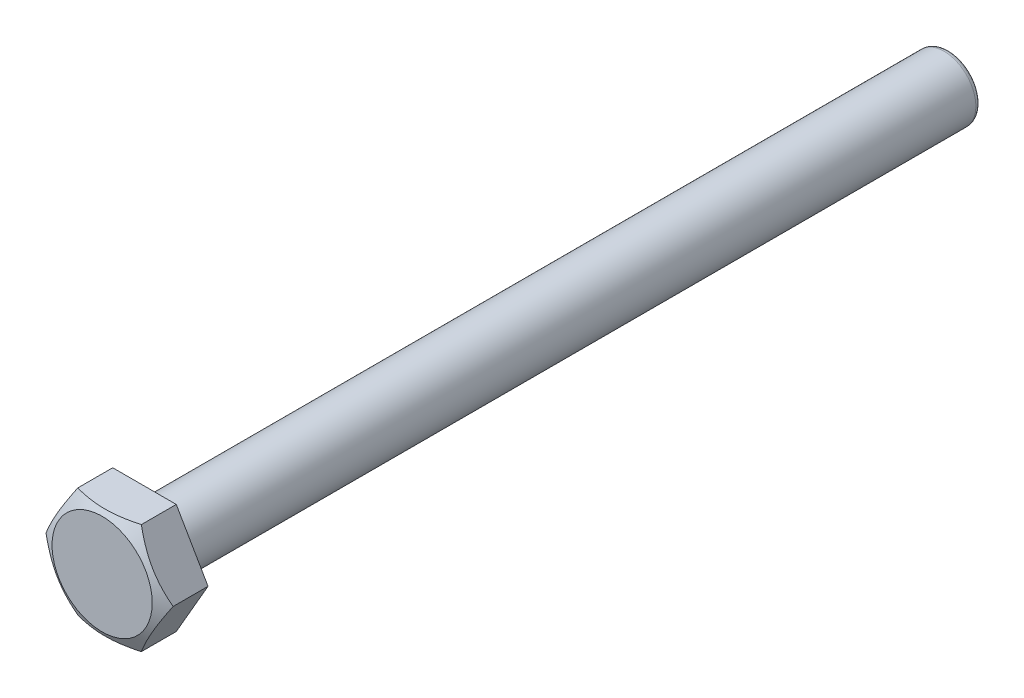
ISO-10303-21;
HEADER;
FILE_DESCRIPTION(('STEP AP214'),'2;1');
FILE_NAME('part.step','',(''),(''),'','','');
FILE_SCHEMA(('AUTOMOTIVE_DESIGN { 1 0 10303 214 1 1 1 1 }'));
ENDSEC;
DATA;
#1=APPLICATION_CONTEXT('core data for automotive mechanical design processes');
#2=APPLICATION_PROTOCOL_DEFINITION('international standard','automotive_design',2000,#1);
#3=PRODUCT_CONTEXT('',#1,'mechanical');
#4=PRODUCT('Part','Part','',(#3));
#5=PRODUCT_RELATED_PRODUCT_CATEGORY('part','',(#4));
#6=PRODUCT_DEFINITION_FORMATION('','',#4);
#7=PRODUCT_DEFINITION_CONTEXT('part definition',#1,'design');
#8=PRODUCT_DEFINITION('design','',#6,#7);
#9=PRODUCT_DEFINITION_SHAPE('','',#8);
#10=(LENGTH_UNIT() NAMED_UNIT(*) SI_UNIT(.MILLI.,.METRE.));
#11=(NAMED_UNIT(*) PLANE_ANGLE_UNIT() SI_UNIT($,.RADIAN.));
#12=(NAMED_UNIT(*) SI_UNIT($,.STERADIAN.) SOLID_ANGLE_UNIT());
#13=UNCERTAINTY_MEASURE_WITH_UNIT(LENGTH_MEASURE(1.E-05),#10,'distance_accuracy_value','');
#14=(GEOMETRIC_REPRESENTATION_CONTEXT(3) GLOBAL_UNCERTAINTY_ASSIGNED_CONTEXT((#13)) GLOBAL_UNIT_ASSIGNED_CONTEXT((#10,
#11,#12)) REPRESENTATION_CONTEXT('',''));
#15=CARTESIAN_POINT('',(0.,0.,0.));
#16=DIRECTION('',(0.,0.,1.));
#17=DIRECTION('',(1.,0.,0.));
#18=AXIS2_PLACEMENT_3D('',#15,#16,#17);
#19=CARTESIAN_POINT('',(3.00000000000005,-5.19615242270659,4.));
#20=DIRECTION('',(-0.866025403784442,0.499999999999995,0.));
#21=DIRECTION('',(-0.499999999999995,-0.866025403784442,0.));
#22=AXIS2_PLACEMENT_3D('',#19,#20,#21);
#23=PLANE('',#22);
#24=CARTESIAN_POINT('',(2.99988452994622,-5.19635242270659,3.29993636752852));
#25=CARTESIAN_POINT('',(3.13120037425521,-4.96890670852461,3.37231821520058));
#26=CARTESIAN_POINT('',(3.26353944494433,-4.73968871426459,3.43812150944553));
#27=CARTESIAN_POINT('',(3.53029736264474,-4.27765044748621,3.55301887201268));
#28=CARTESIAN_POINT('',(3.6647200634845,-4.04482349994109,3.60207677825998));
#29=CARTESIAN_POINT('',(3.93206789695309,-3.58176346908004,3.67871603562647));
#30=CARTESIAN_POINT('',(4.06495857356462,-3.35159006533665,3.70675619592674));
#31=CARTESIAN_POINT('',(4.26473017311514,-3.00557550500584,3.73217837172106));
#32=CARTESIAN_POINT('',(4.33136469480456,-2.89016112790172,3.73788053333798));
#33=CARTESIAN_POINT('',(4.46469401785052,-2.65922796624735,3.74364269272623));
#34=CARTESIAN_POINT('',(4.53138881755607,-2.5437091845567,3.74370284061096));
#35=CARTESIAN_POINT('',(4.71539831783398,-2.224995381,3.7360427664145));
#36=CARTESIAN_POINT('',(4.83266210158002,-2.02188854966408,3.72237485742094));
#37=CARTESIAN_POINT('',(5.06648407118686,-1.61689701837921,3.67845149833568));
#38=CARTESIAN_POINT('',(5.18304158332952,-1.41501348534429,3.64818215602633));
#39=CARTESIAN_POINT('',(5.41730652919732,-1.00925469666888,3.57229441079438));
#40=CARTESIAN_POINT('',(5.53498909636899,-0.805422511162419,3.52637619610927));
#41=CARTESIAN_POINT('',(5.76874191762245,-0.400550748338854,3.42195798803959));
#42=CARTESIAN_POINT('',(5.88481466437232,-0.199506853594004,3.36348048890669));
#43=CARTESIAN_POINT('',(6.00011547005383,0.000199999999999686,3.29993636752853));
#44=B_SPLINE_CURVE_WITH_KNOTS('',3,(#24,#25,#26,#27,#28,#29,#30,#31,#32,#33,#34,#35,#36,#37,#38,
#39,#40,#41,#42,#43),.UNSPECIFIED.,.F.,.F.,(4,2,2,2,2,2,2,2,2,4),(0.,0.817519463468259,
1.63679337331425,2.43761566578922,2.83768454355232,3.23774277694015,3.94183837221327,
4.64652406150167,5.3655497848344,6.08329828274132),.UNSPECIFIED.);
#45=CARTESIAN_POINT('',(3.00000000000006,-5.19615242270659,3.3));
#46=VERTEX_POINT('',#45);
#47=CARTESIAN_POINT('',(5.99999999999999,0.,3.3));
#48=VERTEX_POINT('',#47);
#49=EDGE_CURVE('E87',#46,#48,#44,.T.);
#50=ORIENTED_EDGE('',*,*,#49,.F.);
#51=DIRECTION('',(0.,0.,-1.));
#52=VECTOR('',#51,1.);
#53=CARTESIAN_POINT('',(3.00000000000005,-5.19615242270659,4.));
#54=LINE('',#53,#52);
#55=CARTESIAN_POINT('',(3.00000000000005,-5.19615242270659,0.));
#56=VERTEX_POINT('',#55);
#57=EDGE_CURVE('E58',#46,#56,#54,.T.);
#58=ORIENTED_EDGE('',*,*,#57,.T.);
#59=DIRECTION('',(0.499999999999995,0.866025403784442,0.));
#60=VECTOR('',#59,1.);
#61=CARTESIAN_POINT('',(3.00000000000005,-5.19615242270659,0.));
#62=LINE('',#61,#60);
#63=CARTESIAN_POINT('',(5.99999999999999,0.,0.));
#64=VERTEX_POINT('',#63);
#65=EDGE_CURVE('E94',#56,#64,#62,.T.);
#66=ORIENTED_EDGE('',*,*,#65,.T.);
#67=DIRECTION('',(0.,0.,-1.));
#68=VECTOR('',#67,1.);
#69=CARTESIAN_POINT('',(5.99999999999999,0.,4.));
#70=LINE('',#69,#68);
#71=EDGE_CURVE('E100',#48,#64,#70,.T.);
#72=ORIENTED_EDGE('',*,*,#71,.F.);
#73=EDGE_LOOP('',(#50,#58,#66,#72));
#74=FACE_BOUND('',#73,.T.);
#75=ADVANCED_FACE('F35',(#74),#23,.F.);
#76=CARTESIAN_POINT('',(5.99999999999999,0.,4.));
#77=DIRECTION('',(-0.866025403784438,-0.500000000000001,0.));
#78=DIRECTION('',(0.500000000000001,-0.866025403784438,0.));
#79=AXIS2_PLACEMENT_3D('',#76,#77,#78);
#80=PLANE('',#79);
#81=CARTESIAN_POINT('',(6.00011547005383,-0.000200000000000011,3.29993636752852));
#82=CARTESIAN_POINT('',(5.86879962574484,0.227245714181975,3.37231821520058));
#83=CARTESIAN_POINT('',(5.73646055505571,0.456463708441989,3.43812150944553));
#84=CARTESIAN_POINT('',(5.4697026373553,0.918501975220374,3.55301887201268));
#85=CARTESIAN_POINT('',(5.33527993651553,1.15132892276549,3.60207677825998));
#86=CARTESIAN_POINT('',(5.06793210304695,1.61438895362654,3.67871603562648));
#87=CARTESIAN_POINT('',(4.93504142643541,1.84456235736993,3.70675619592675));
#88=CARTESIAN_POINT('',(4.73526982688489,2.19057691770073,3.73217837172107));
#89=CARTESIAN_POINT('',(4.66863530519547,2.30599129480486,3.73788053333799));
#90=CARTESIAN_POINT('',(4.5353059821495,2.53692445645923,3.74364269272624));
#91=CARTESIAN_POINT('',(4.46861118244395,2.65244323814987,3.74370284061097));
#92=CARTESIAN_POINT('',(4.28460168216604,2.97115704170658,3.73604276641452));
#93=CARTESIAN_POINT('',(4.16733789841999,3.1742638730425,3.72237485742095));
#94=CARTESIAN_POINT('',(3.93351592881314,3.57925540432739,3.67845149833569));
#95=CARTESIAN_POINT('',(3.81695841667048,3.78113893736231,3.64818215602635));
#96=CARTESIAN_POINT('',(3.58269347080267,4.18689772603772,3.57229441079439));
#97=CARTESIAN_POINT('',(3.465010903631,4.39072991154419,3.52637619610928));
#98=CARTESIAN_POINT('',(3.23125808237753,4.79560167436776,3.4219579880396));
#99=CARTESIAN_POINT('',(3.11518533562766,4.99664556911262,3.36348048890669));
#100=CARTESIAN_POINT('',(2.99988452994614,5.19635242270663,3.29993636752853));
#101=B_SPLINE_CURVE_WITH_KNOTS('',3,(#81,#82,#83,#84,#85,#86,#87,#88,#89,#90,#91,#92,#93,#94,
#95,#96,#97,#98,#99,#100),.UNSPECIFIED.,.F.,.F.,(4,2,2,2,2,2,2,2,2,4),(0.,0.817519463468258,
1.63679337331425,2.43761566578922,2.83768454355232,3.23774277694015,3.94183837221328,
4.64652406150171,5.36554978483446,6.0832982827414),.UNSPECIFIED.);
#102=CARTESIAN_POINT('',(2.99999999999998,5.19615242270663,3.3));
#103=VERTEX_POINT('',#102);
#104=EDGE_CURVE('E90',#48,#103,#101,.T.);
#105=ORIENTED_EDGE('',*,*,#104,.F.);
#106=ORIENTED_EDGE('',*,*,#71,.T.);
#107=DIRECTION('',(-0.500000000000001,0.866025403784438,0.));
#108=VECTOR('',#107,1.);
#109=CARTESIAN_POINT('',(5.99999999999999,0.,0.));
#110=LINE('',#109,#108);
#111=CARTESIAN_POINT('',(2.99999999999998,5.19615242270663,0.));
#112=VERTEX_POINT('',#111);
#113=EDGE_CURVE('E209',#64,#112,#110,.T.);
#114=ORIENTED_EDGE('',*,*,#113,.T.);
#115=DIRECTION('',(0.,0.,-1.));
#116=VECTOR('',#115,1.);
#117=CARTESIAN_POINT('',(2.99999999999998,5.19615242270663,4.));
#118=LINE('',#117,#116);
#119=EDGE_CURVE('E102',#103,#112,#118,.T.);
#120=ORIENTED_EDGE('',*,*,#119,.F.);
#121=EDGE_LOOP('',(#105,#106,#114,#120));
#122=FACE_BOUND('',#121,.T.);
#123=ADVANCED_FACE('F98',(#122),#80,.F.);
#124=CARTESIAN_POINT('',(2.99999999999998,5.19615242270663,4.));
#125=DIRECTION('',(0.,-1.,0.));
#126=DIRECTION('',(1.,0.,0.));
#127=AXIS2_PLACEMENT_3D('',#124,#125,#126);
#128=PLANE('',#127);
#129=CARTESIAN_POINT('',(-7.92198431592787,5.19615242270659,1.38559266034994));
#130=CARTESIAN_POINT('',(-7.69326227954885,5.19615242270659,1.49095278034008));
#131=CARTESIAN_POINT('',(-7.46403330139792,5.19615242270659,1.59523252212606));
#132=CARTESIAN_POINT('',(-7.00428906400931,5.19615242270659,1.80101597831413));
#133=CARTESIAN_POINT('',(-6.77377360014843,5.19615242270659,1.90251923501786));
#134=CARTESIAN_POINT('',(-6.31002575217176,5.1961524227066,2.10263157928218));
#135=CARTESIAN_POINT('',(-6.0767854350624,5.1961524227066,2.20122234966374));
#136=CARTESIAN_POINT('',(-5.60851628234075,5.1961524227066,2.39404413592184));
#137=CARTESIAN_POINT('',(-5.37348753503331,5.1961524227066,2.48827536544762));
#138=CARTESIAN_POINT('',(-4.89904131503442,5.1961524227066,2.67209286409355));
#139=CARTESIAN_POINT('',(-4.65960336015394,5.1961524227066,2.7616265569743));
#140=CARTESIAN_POINT('',(-4.17811783883686,5.1961524227066,2.93351382581167));
#141=CARTESIAN_POINT('',(-3.93607001357712,5.1961524227066,3.01586668214091));
#142=CARTESIAN_POINT('',(-3.44949172318917,5.19615242270661,3.17118551715607));
#143=CARTESIAN_POINT('',(-3.2049672843446,5.19615242270661,3.24417018327577));
#144=CARTESIAN_POINT('',(-2.71274475935278,5.19615242270661,3.37838550758616));
#145=CARTESIAN_POINT('',(-2.46504760997054,5.19615242270661,3.43961955361462));
#146=CARTESIAN_POINT('',(-1.96632403136333,5.19615242270661,3.5474117726451));
#147=CARTESIAN_POINT('',(-1.71529638995956,5.19615242270661,3.59396444046187));
#148=CARTESIAN_POINT('',(-1.21052002960329,5.19615242270661,3.66933556405531));
#149=CARTESIAN_POINT('',(-0.956771219161599,5.19615242270661,3.69815342165098));
#150=CARTESIAN_POINT('',(-0.449115035776771,5.19615242270662,3.7356137354557));
#151=CARTESIAN_POINT('',(-0.195215761662992,5.19615242270662,3.74436321942582));
#152=CARTESIAN_POINT('',(0.312390311797005,5.19615242270662,3.7412051851038));
#153=CARTESIAN_POINT('',(0.566097144884676,5.19615242270662,3.72930335153118));
#154=CARTESIAN_POINT('',(1.01176749789605,5.19615242270662,3.69108715053189));
#155=CARTESIAN_POINT('',(1.20409897173807,5.19615242270662,3.66886211887566));
#156=CARTESIAN_POINT('',(1.58729792803549,5.19615242270662,3.61408305260569));
#157=CARTESIAN_POINT('',(1.77816515276921,5.19615242270662,3.58152724054171));
#158=CARTESIAN_POINT('',(2.34892228539402,5.19615242270663,3.47013116561713));
#159=CARTESIAN_POINT('',(2.72616893315937,5.19615242270663,3.37764053263401));
#160=CARTESIAN_POINT('',(3.29043142538852,5.19615242270663,3.21834555065987));
#161=CARTESIAN_POINT('',(3.48030711122072,5.19615242270663,3.16108090431709));
#162=CARTESIAN_POINT('',(3.85830568868335,5.19615242270663,3.04092666432027));
#163=CARTESIAN_POINT('',(4.04642842551327,5.19615242270663,2.97803657899323));
#164=CARTESIAN_POINT('',(4.41994249881478,5.19615242270663,2.84802755076435));
#165=CARTESIAN_POINT('',(4.60534341034003,5.19615242270663,2.78093582891764));
#166=CARTESIAN_POINT('',(4.97466674191132,5.19615242270664,2.64297814233672));
#167=CARTESIAN_POINT('',(5.15858964286321,5.19615242270664,2.57211346761545));
#168=CARTESIAN_POINT('',(5.34189920565052,5.19615242270664,2.49973208755415));
#169=B_SPLINE_CURVE_WITH_KNOTS('',3,(#129,#130,#131,#132,#133,#134,#135,#136,#137,#138,#139,
#140,#141,#142,#143,#144,#145,#146,#147,#148,#149,#150,#151,#152,#153,#154,#155,#156,#157,#158,
#159,#160,#161,#162,#163,#164,#165,#166,#167,#168),.UNSPECIFIED.,.F.,.F.,(4,2,2,2,2,2,2,2,2,2,2,
2,2,2,2,2,2,2,2,4),(0.,0.755476989475552,1.51107777640751,2.27070737140927,3.03029969950886,
3.7971016321675,4.56398032175718,5.32930466697557,6.09440802784875,6.85979794501777,
7.62521367676295,8.38653773982239,9.14765226529749,9.72819096907238,10.308829610956,
11.472503627369,12.0674314382528,12.6624112977505,13.2538710123172,13.8451297831649),.UNSPECIFIED.);
#170=CARTESIAN_POINT('',(-3.00000000000002,5.19615242270661,3.3));
#171=VERTEX_POINT('',#170);
#172=EDGE_CURVE('E103',#103,#171,#169,.F.);
#173=ORIENTED_EDGE('',*,*,#172,.F.);
#174=ORIENTED_EDGE('',*,*,#119,.T.);
#175=DIRECTION('',(-1.,0.,0.));
#176=VECTOR('',#175,1.);
#177=CARTESIAN_POINT('',(2.99999999999998,5.19615242270663,0.));
#178=LINE('',#177,#176);
#179=CARTESIAN_POINT('',(-3.00000000000002,5.19615242270661,0.));
#180=VERTEX_POINT('',#179);
#181=EDGE_CURVE('E210',#112,#180,#178,.T.);
#182=ORIENTED_EDGE('',*,*,#181,.T.);
#183=DIRECTION('',(0.,0.,-1.));
#184=VECTOR('',#183,1.);
#185=CARTESIAN_POINT('',(-3.00000000000002,5.19615242270661,4.));
#186=LINE('',#185,#184);
#187=EDGE_CURVE('E110',#171,#180,#186,.T.);
#188=ORIENTED_EDGE('',*,*,#187,.F.);
#189=EDGE_LOOP('',(#173,#174,#182,#188));
#190=FACE_BOUND('',#189,.T.);
#191=ADVANCED_FACE('F130',(#190),#128,.F.);
#192=CARTESIAN_POINT('',(-3.00000000000002,5.19615242270661,4.));
#193=DIRECTION('',(0.866025403784442,-0.499999999999995,0.));
#194=DIRECTION('',(0.499999999999995,0.866025403784442,0.));
#195=AXIS2_PLACEMENT_3D('',#192,#193,#194);
#196=PLANE('',#195);
#197=CARTESIAN_POINT('',(-2.99988452994618,5.19635242270661,3.29993636752853));
#198=CARTESIAN_POINT('',(-3.13120037425517,4.96890670852463,3.37231821520058));
#199=CARTESIAN_POINT('',(-3.26353944494429,4.73968871426462,3.43812150944553));
#200=CARTESIAN_POINT('',(-3.5302973626447,4.27765044748623,3.55301887201268));
#201=CARTESIAN_POINT('',(-3.66472006348447,4.04482349994112,3.60207677825998));
#202=CARTESIAN_POINT('',(-3.93206789695305,3.58176346908006,3.67871603562648));
#203=CARTESIAN_POINT('',(-4.06495857356459,3.35159006533667,3.70675619592675));
#204=CARTESIAN_POINT('',(-4.26473017311511,3.00557550500586,3.73217837172107));
#205=CARTESIAN_POINT('',(-4.33136469480452,2.89016112790174,3.73788053333799));
#206=CARTESIAN_POINT('',(-4.46469401785049,2.65922796624737,3.74364269272624));
#207=CARTESIAN_POINT('',(-4.53138881755604,2.54370918455672,3.74370284061097));
#208=CARTESIAN_POINT('',(-4.71539831783395,2.22499538100002,3.73604276641452));
#209=CARTESIAN_POINT('',(-4.83266210157999,2.0218885496641,3.72237485742095));
#210=CARTESIAN_POINT('',(-5.06648407118684,1.61689701837921,3.67845149833569));
#211=CARTESIAN_POINT('',(-5.1830415833295,1.41501348534428,3.64818215602635));
#212=CARTESIAN_POINT('',(-5.41730652919731,1.00925469666887,3.57229441079439));
#213=CARTESIAN_POINT('',(-5.53498909636898,0.805422511162398,3.52637619610928));
#214=CARTESIAN_POINT('',(-5.76874191762244,0.400550748338822,3.42195798803959));
#215=CARTESIAN_POINT('',(-5.88481466437231,0.199506853593967,3.36348048890669));
#216=CARTESIAN_POINT('',(-6.00011547005383,-0.000200000000041801,3.29993636752853));
#217=B_SPLINE_CURVE_WITH_KNOTS('',3,(#197,#198,#199,#200,#201,#202,#203,#204,#205,#206,#207,
#208,#209,#210,#211,#212,#213,#214,#215,#216),.UNSPECIFIED.,.F.,.F.,(4,2,2,2,2,2,2,2,2,4),(0.,
0.817519463468259,1.63679337331425,2.43761566578922,2.83768454355232,3.23774277694015,
3.94183837221328,4.64652406150171,5.36554978483446,6.0832982827414),.UNSPECIFIED.);
#218=CARTESIAN_POINT('',(-5.99999999999999,0.,3.3));
#219=VERTEX_POINT('',#218);
#220=EDGE_CURVE('E174',#171,#219,#217,.T.);
#221=ORIENTED_EDGE('',*,*,#220,.F.);
#222=ORIENTED_EDGE('',*,*,#187,.T.);
#223=DIRECTION('',(-0.499999999999995,-0.866025403784442,0.));
#224=VECTOR('',#223,1.);
#225=CARTESIAN_POINT('',(-3.00000000000002,5.19615242270661,0.));
#226=LINE('',#225,#224);
#227=CARTESIAN_POINT('',(-5.99999999999999,0.,0.));
#228=VERTEX_POINT('',#227);
#229=EDGE_CURVE('E212',#180,#228,#226,.T.);
#230=ORIENTED_EDGE('',*,*,#229,.T.);
#231=DIRECTION('',(0.,0.,-1.));
#232=VECTOR('',#231,1.);
#233=CARTESIAN_POINT('',(-5.99999999999999,0.,4.));
#234=LINE('',#233,#232);
#235=EDGE_CURVE('E224',#219,#228,#234,.T.);
#236=ORIENTED_EDGE('',*,*,#235,.F.);
#237=EDGE_LOOP('',(#221,#222,#230,#236));
#238=FACE_BOUND('',#237,.T.);
#239=ADVANCED_FACE('F186',(#238),#196,.F.);
#240=CARTESIAN_POINT('',(-5.99999999999999,0.,4.));
#241=DIRECTION('',(0.866025403784434,0.500000000000007,0.));
#242=DIRECTION('',(-0.500000000000007,0.866025403784435,0.));
#243=AXIS2_PLACEMENT_3D('',#240,#241,#242);
#244=PLANE('',#243);
#245=CARTESIAN_POINT('',(-6.00011547005383,0.000199999999958112,3.29993636752852));
#246=CARTESIAN_POINT('',(-5.86879962574483,-0.227245714182017,3.37231821520058));
#247=CARTESIAN_POINT('',(-5.73646055505571,-0.45646370844203,3.43812150944553));
#248=CARTESIAN_POINT('',(-5.46970263735529,-0.918501975220413,3.55301887201268));
#249=CARTESIAN_POINT('',(-5.33527993651552,-1.15132892276552,3.60207677825998));
#250=CARTESIAN_POINT('',(-5.06793210304693,-1.61438895362657,3.67871603562648));
#251=CARTESIAN_POINT('',(-4.93504142643539,-1.84456235736996,3.70675619592675));
#252=CARTESIAN_POINT('',(-4.73526982688487,-2.19057691770077,3.73217837172107));
#253=CARTESIAN_POINT('',(-4.66863530519545,-2.30599129480489,3.73788053333799));
#254=CARTESIAN_POINT('',(-4.53530598214949,-2.53692445645926,3.74364269272624));
#255=CARTESIAN_POINT('',(-4.46861118244393,-2.6524432381499,3.74370284061097));
#256=CARTESIAN_POINT('',(-4.28460168216602,-2.97115704170661,3.73604276641452));
#257=CARTESIAN_POINT('',(-4.16733789841997,-3.17426387304253,3.72237485742095));
#258=CARTESIAN_POINT('',(-3.93351592881312,-3.57925540432741,3.67845149833569));
#259=CARTESIAN_POINT('',(-3.81695841667045,-3.78113893736233,3.64818215602635));
#260=CARTESIAN_POINT('',(-3.58269347080264,-4.18689772603775,3.57229441079439));
#261=CARTESIAN_POINT('',(-3.46501090363097,-4.39072991154421,3.52637619610928));
#262=CARTESIAN_POINT('',(-3.2312580823775,-4.79560167436779,3.42195798803959));
#263=CARTESIAN_POINT('',(-3.11518533562762,-4.99664556911264,3.36348048890669));
#264=CARTESIAN_POINT('',(-2.99988452994611,-5.19635242270665,3.29993636752853));
#265=B_SPLINE_CURVE_WITH_KNOTS('',3,(#245,#246,#247,#248,#249,#250,#251,#252,#253,#254,#255,
#256,#257,#258,#259,#260,#261,#262,#263,#264),.UNSPECIFIED.,.F.,.F.,(4,2,2,2,2,2,2,2,2,4),(0.,
0.817519463468259,1.63679337331425,2.43761566578922,2.83768454355232,3.23774277694015,
3.94183837221328,4.64652406150171,5.36554978483446,6.0832982827414),.UNSPECIFIED.);
#266=CARTESIAN_POINT('',(-2.99999999999995,-5.19615242270665,3.3));
#267=VERTEX_POINT('',#266);
#268=EDGE_CURVE('E50',#219,#267,#265,.T.);
#269=ORIENTED_EDGE('',*,*,#268,.F.);
#270=ORIENTED_EDGE('',*,*,#235,.T.);
#271=DIRECTION('',(0.500000000000007,-0.866025403784435,0.));
#272=VECTOR('',#271,1.);
#273=CARTESIAN_POINT('',(-5.99999999999999,0.,0.));
#274=LINE('',#273,#272);
#275=CARTESIAN_POINT('',(-2.99999999999995,-5.19615242270665,0.));
#276=VERTEX_POINT('',#275);
#277=EDGE_CURVE('E217',#228,#276,#274,.T.);
#278=ORIENTED_EDGE('',*,*,#277,.T.);
#279=DIRECTION('',(0.,0.,-1.));
#280=VECTOR('',#279,1.);
#281=CARTESIAN_POINT('',(-2.99999999999995,-5.19615242270665,4.));
#282=LINE('',#281,#280);
#283=EDGE_CURVE('E222',#267,#276,#282,.T.);
#284=ORIENTED_EDGE('',*,*,#283,.F.);
#285=EDGE_LOOP('',(#269,#270,#278,#284));
#286=FACE_BOUND('',#285,.T.);
#287=ADVANCED_FACE('F190',(#286),#244,.F.);
#288=CARTESIAN_POINT('',(-2.99999999999995,-5.19615242270665,4.));
#289=DIRECTION('',(0.,1.,0.));
#290=DIRECTION('',(-1.,0.,0.));
#291=AXIS2_PLACEMENT_3D('',#288,#289,#290);
#292=PLANE('',#291);
#293=CARTESIAN_POINT('',(-7.9219843159364,-5.1961524227067,1.38559266034597));
#294=CARTESIAN_POINT('',(-7.69326227955707,-5.1961524227067,1.49095278033629));
#295=CARTESIAN_POINT('',(-7.46403330140585,-5.1961524227067,1.59523252212244));
#296=CARTESIAN_POINT('',(-7.00428906401664,-5.19615242270669,1.80101597831085));
#297=CARTESIAN_POINT('',(-6.77377360015545,-5.19615242270669,1.90251923501476));
#298=CARTESIAN_POINT('',(-6.31002575217818,-5.19615242270668,2.10263157927942));
#299=CARTESIAN_POINT('',(-6.07678543506851,-5.19615242270668,2.20122234966115));
#300=CARTESIAN_POINT('',(-5.60851628234625,-5.19615242270668,2.39404413591958));
#301=CARTESIAN_POINT('',(-5.3734875350385,-5.19615242270667,2.48827536544553));
#302=CARTESIAN_POINT('',(-4.89904131503899,-5.19615242270667,2.6720928640918));
#303=CARTESIAN_POINT('',(-4.6596033601582,-5.19615242270667,2.76162655697271));
#304=CARTESIAN_POINT('',(-4.17811783884049,-5.19615242270666,2.93351382581039));
#305=CARTESIAN_POINT('',(-3.93607001358043,-5.19615242270666,3.01586668213979));
#306=CARTESIAN_POINT('',(-3.44949172319183,-5.19615242270665,3.17118551715524));
#307=CARTESIAN_POINT('',(-3.20496728434694,-5.19615242270665,3.24417018327508));
#308=CARTESIAN_POINT('',(-2.71274475935446,-5.19615242270665,3.37838550758572));
#309=CARTESIAN_POINT('',(-2.46504760997189,-5.19615242270664,3.43961955361429));
#310=CARTESIAN_POINT('',(-1.96632403136384,-5.19615242270664,3.54741177264499));
#311=CARTESIAN_POINT('',(-1.71529638995957,-5.19615242270664,3.59396444046187));
#312=CARTESIAN_POINT('',(-1.21052002960228,-5.19615242270663,3.66933556405544));
#313=CARTESIAN_POINT('',(-0.956771219160083,-5.19615242270663,3.69815342165114));
#314=CARTESIAN_POINT('',(-0.449115035774232,-5.19615242270662,3.73561373545583));
#315=CARTESIAN_POINT('',(-0.195215761659943,-5.19615242270662,3.7443632194259));
#316=CARTESIAN_POINT('',(0.312390311801067,-5.19615242270661,3.74120518510368));
#317=CARTESIAN_POINT('',(0.566097144889241,-5.19615242270661,3.72930335153092));
#318=CARTESIAN_POINT('',(1.01176749790127,-5.19615242270661,3.69108715053135));
#319=CARTESIAN_POINT('',(1.20409897174345,-5.1961524227066,3.668862118875));
#320=CARTESIAN_POINT('',(1.58729792804118,-5.1961524227066,3.61408305260479));
#321=CARTESIAN_POINT('',(1.77816515277504,-5.1961524227066,3.58152724054068));
#322=CARTESIAN_POINT('',(2.34892228540029,-5.19615242270659,3.47013116561572));
#323=CARTESIAN_POINT('',(2.72616893316593,-5.19615242270659,3.37764053263235));
#324=CARTESIAN_POINT('',(3.29043142539551,-5.19615242270658,3.21834555065783));
#325=CARTESIAN_POINT('',(3.48030711122786,-5.19615242270658,3.16108090431492));
#326=CARTESIAN_POINT('',(3.85830568869077,-5.19615242270658,3.04092666431786));
#327=CARTESIAN_POINT('',(4.04642842552084,-5.19615242270658,2.97803657899069));
#328=CARTESIAN_POINT('',(4.41994249882263,-5.19615242270657,2.84802755076157));
#329=CARTESIAN_POINT('',(4.60534341034803,-5.19615242270657,2.78093582891474));
#330=CARTESIAN_POINT('',(4.9746667419196,-5.19615242270657,2.64297814233359));
#331=CARTESIAN_POINT('',(5.15858964287163,-5.19615242270656,2.57211346761221));
#332=CARTESIAN_POINT('',(5.34189920565909,-5.19615242270656,2.4997320875508));
#333=B_SPLINE_CURVE_WITH_KNOTS('',3,(#293,#294,#295,#296,#297,#298,#299,#300,#301,#302,#303,
#304,#305,#306,#307,#308,#309,#310,#311,#312,#313,#314,#315,#316,#317,#318,#319,#320,#321,#322,
#323,#324,#325,#326,#327,#328,#329,#330,#331,#332),.UNSPECIFIED.,.F.,.F.,(4,2,2,2,2,2,2,2,2,2,2,
2,2,2,2,2,2,2,2,4),(0.,0.755476989476585,1.51107777640957,2.27070737141238,3.03029969951301,
3.7971016321727,4.56398032176344,5.32930466698288,6.09440802785712,6.85979794502767,
7.62521367677438,8.38653773983533,9.14765226531196,9.72819096908735,10.3088296109715,
11.4725036273855,12.0674314382699,12.6624112977681,13.2538710123352,13.8451297831835),.UNSPECIFIED.);
#334=EDGE_CURVE('E92',#267,#46,#333,.T.);
#335=ORIENTED_EDGE('',*,*,#334,.F.);
#336=ORIENTED_EDGE('',*,*,#283,.T.);
#337=DIRECTION('',(1.,0.,0.));
#338=VECTOR('',#337,1.);
#339=CARTESIAN_POINT('',(-2.99999999999995,-5.19615242270665,0.));
#340=LINE('',#339,#338);
#341=EDGE_CURVE('E207',#276,#56,#340,.T.);
#342=ORIENTED_EDGE('',*,*,#341,.T.);
#343=ORIENTED_EDGE('',*,*,#57,.F.);
#344=EDGE_LOOP('',(#335,#336,#342,#343));
#345=FACE_BOUND('',#344,.T.);
#346=ADVANCED_FACE('F194',(#345),#292,.F.);
#347=CARTESIAN_POINT('',(0.,0.,0.));
#348=DIRECTION('',(0.,0.,1.));
#349=DIRECTION('',(1.,0.,0.));
#350=AXIS2_PLACEMENT_3D('',#347,#348,#349);
#351=PLANE('',#350);
#352=CARTESIAN_POINT('',(0.,0.,0.));
#353=DIRECTION('',(0.,0.,-1.));
#354=DIRECTION('',(-1.,0.,0.));
#355=AXIS2_PLACEMENT_3D('',#352,#353,#354);
#356=CIRCLE('',#355,3.);
#357=CARTESIAN_POINT('',(-3.,0.,0.));
#358=VERTEX_POINT('',#357);
#359=EDGE_CURVE('E106',#358,#358,#356,.T.);
#360=ORIENTED_EDGE('',*,*,#359,.F.);
#361=EDGE_LOOP('',(#360));
#362=FACE_BOUND('',#361,.T.);
#363=ORIENTED_EDGE('',*,*,#65,.F.);
#364=ORIENTED_EDGE('',*,*,#341,.F.);
#365=ORIENTED_EDGE('',*,*,#277,.F.);
#366=ORIENTED_EDGE('',*,*,#229,.F.);
#367=ORIENTED_EDGE('',*,*,#181,.F.);
#368=ORIENTED_EDGE('',*,*,#113,.F.);
#369=EDGE_LOOP('',(#363,#364,#365,#366,#367,#368));
#370=FACE_BOUND('',#369,.T.);
#371=ADVANCED_FACE('F152',(#362,#370),#351,.F.);
#372=CARTESIAN_POINT('',(0.,0.,4.));
#373=DIRECTION('',(0.,0.,-1.));
#374=DIRECTION('',(-1.,0.,0.));
#375=AXIS2_PLACEMENT_3D('',#372,#373,#374);
#376=CONICAL_SURFACE('',#375,4.72971504798533,1.06714160840094);
#377=CARTESIAN_POINT('',(0.,0.,4.));
#378=DIRECTION('',(0.,0.,1.));
#379=DIRECTION('',(1.,0.,0.));
#380=AXIS2_PLACEMENT_3D('',#377,#378,#379);
#381=CIRCLE('',#380,4.72971504798533);
#382=CARTESIAN_POINT('',(4.72971504798533,0.,4.));
#383=VERTEX_POINT('',#382);
#384=EDGE_CURVE('E230',#383,#383,#381,.T.);
#385=ORIENTED_EDGE('',*,*,#384,.F.);
#386=EDGE_LOOP('',(#385));
#387=FACE_BOUND('',#386,.T.);
#388=ORIENTED_EDGE('',*,*,#49,.T.);
#389=ORIENTED_EDGE('',*,*,#104,.T.);
#390=ORIENTED_EDGE('',*,*,#172,.T.);
#391=ORIENTED_EDGE('',*,*,#220,.T.);
#392=ORIENTED_EDGE('',*,*,#268,.T.);
#393=ORIENTED_EDGE('',*,*,#334,.T.);
#394=EDGE_LOOP('',(#388,#389,#390,#391,#392,#393));
#395=FACE_BOUND('',#394,.T.);
#396=ADVANCED_FACE('F89',(#387,#395),#376,.T.);
#397=CARTESIAN_POINT('',(0.,0.,4.));
#398=DIRECTION('',(0.,0.,1.));
#399=DIRECTION('',(1.,0.,0.));
#400=AXIS2_PLACEMENT_3D('',#397,#398,#399);
#401=PLANE('',#400);
#402=ORIENTED_EDGE('',*,*,#384,.T.);
#403=EDGE_LOOP('',(#402));
#404=FACE_BOUND('',#403,.T.);
#405=ADVANCED_FACE('F151',(#404),#401,.T.);
#406=CARTESIAN_POINT('',(0.,0.,-76.));
#407=DIRECTION('',(0.,0.,1.));
#408=DIRECTION('',(1.,0.,0.));
#409=AXIS2_PLACEMENT_3D('',#406,#407,#408);
#410=CYLINDRICAL_SURFACE('',#409,3.);
#411=CARTESIAN_POINT('',(0.,0.,-75.5));
#412=DIRECTION('',(0.,0.,-1.));
#413=DIRECTION('',(-1.,0.,0.));
#414=AXIS2_PLACEMENT_3D('',#411,#412,#413);
#415=CIRCLE('',#414,3.);
#416=CARTESIAN_POINT('',(-3.,0.,-75.5));
#417=VERTEX_POINT('',#416);
#418=EDGE_CURVE('E11',#417,#417,#415,.F.);
#419=ORIENTED_EDGE('',*,*,#418,.T.);
#420=EDGE_LOOP('',(#419));
#421=FACE_BOUND('',#420,.T.);
#422=ORIENTED_EDGE('',*,*,#359,.T.);
#423=EDGE_LOOP('',(#422));
#424=FACE_BOUND('',#423,.T.);
#425=ADVANCED_FACE('F123',(#421,#424),#410,.T.);
#426=CARTESIAN_POINT('',(0.,0.,-76.));
#427=DIRECTION('',(0.,0.,-1.));
#428=DIRECTION('',(-1.,0.,0.));
#429=AXIS2_PLACEMENT_3D('',#426,#427,#428);
#430=PLANE('',#429);
#431=CARTESIAN_POINT('',(0.,0.,-76.));
#432=DIRECTION('',(0.,0.,-1.));
#433=DIRECTION('',(-1.,0.,0.));
#434=AXIS2_PLACEMENT_3D('',#431,#432,#433);
#435=CIRCLE('',#434,2.5);
#436=CARTESIAN_POINT('',(-2.5,0.,-76.));
#437=VERTEX_POINT('',#436);
#438=EDGE_CURVE('E43',#437,#437,#435,.T.);
#439=ORIENTED_EDGE('',*,*,#438,.T.);
#440=EDGE_LOOP('',(#439));
#441=FACE_BOUND('',#440,.T.);
#442=ADVANCED_FACE('F116',(#441),#430,.T.);
#443=CARTESIAN_POINT('',(0.,0.,-75.5));
#444=DIRECTION('',(0.,0.,-1.));
#445=DIRECTION('',(-1.,0.,0.));
#446=AXIS2_PLACEMENT_3D('',#443,#444,#445);
#447=TOROIDAL_SURFACE('',#446,2.5,0.5);
#448=ORIENTED_EDGE('',*,*,#418,.F.);
#449=EDGE_LOOP('',(#448));
#450=FACE_BOUND('',#449,.T.);
#451=ORIENTED_EDGE('',*,*,#438,.F.);
#452=EDGE_LOOP('',(#451));
#453=FACE_BOUND('',#452,.T.);
#454=ADVANCED_FACE('F37',(#450,#453),#447,.T.);
#455=CLOSED_SHELL('',(#75,#123,#191,#239,#287,#346,#371,#396,#405,#425,#442,#454));
#456=MANIFOLD_SOLID_BREP('B2',#455);
#457=ADVANCED_BREP_SHAPE_REPRESENTATION('',(#18,#456),#14);
#458=SHAPE_DEFINITION_REPRESENTATION(#9,#457);
ENDSEC;
END-ISO-10303-21;
